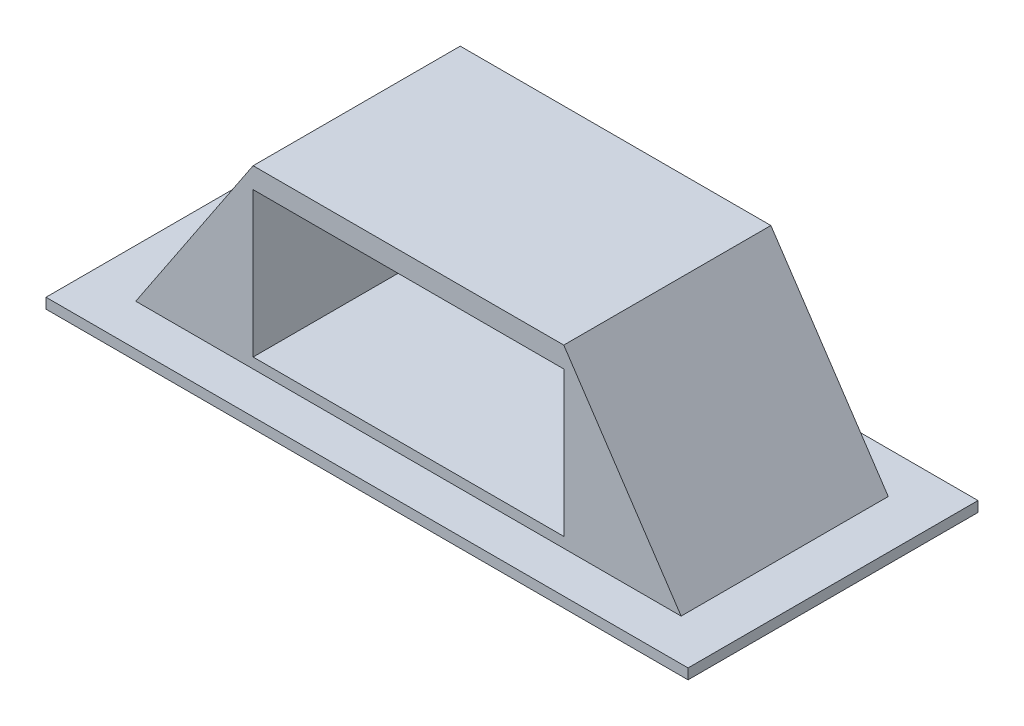
ISO-10303-21;
HEADER;
FILE_DESCRIPTION(('STEP AP214'),'2;1');
FILE_NAME('part.step','',(''),(''),'','','');
FILE_SCHEMA(('AUTOMOTIVE_DESIGN { 1 0 10303 214 1 1 1 1 }'));
ENDSEC;
DATA;
#1=APPLICATION_CONTEXT('core data for automotive mechanical design processes');
#2=APPLICATION_PROTOCOL_DEFINITION('international standard','automotive_design',2000,#1);
#3=PRODUCT_CONTEXT('',#1,'mechanical');
#4=PRODUCT('Part','Part','',(#3));
#5=PRODUCT_RELATED_PRODUCT_CATEGORY('part','',(#4));
#6=PRODUCT_DEFINITION_FORMATION('','',#4);
#7=PRODUCT_DEFINITION_CONTEXT('part definition',#1,'design');
#8=PRODUCT_DEFINITION('design','',#6,#7);
#9=PRODUCT_DEFINITION_SHAPE('','',#8);
#10=(LENGTH_UNIT() NAMED_UNIT(*) SI_UNIT(.MILLI.,.METRE.));
#11=(NAMED_UNIT(*) PLANE_ANGLE_UNIT() SI_UNIT($,.RADIAN.));
#12=(NAMED_UNIT(*) SI_UNIT($,.STERADIAN.) SOLID_ANGLE_UNIT());
#13=UNCERTAINTY_MEASURE_WITH_UNIT(LENGTH_MEASURE(1.E-05),#10,'distance_accuracy_value','');
#14=(GEOMETRIC_REPRESENTATION_CONTEXT(3) GLOBAL_UNCERTAINTY_ASSIGNED_CONTEXT((#13)) GLOBAL_UNIT_ASSIGNED_CONTEXT((#10,
#11,#12)) REPRESENTATION_CONTEXT('',''));
#15=CARTESIAN_POINT('',(0.,0.,0.));
#16=DIRECTION('',(0.,0.,1.));
#17=DIRECTION('',(1.,0.,0.));
#18=AXIS2_PLACEMENT_3D('',#15,#16,#17);
#19=CARTESIAN_POINT('',(-75.,90.,50.));
#20=DIRECTION('',(0.,0.,-1.));
#21=DIRECTION('',(-1.,0.,0.));
#22=AXIS2_PLACEMENT_3D('',#19,#20,#21);
#23=PLANE('',#22);
#24=DIRECTION('',(0.,-1.,0.));
#25=VECTOR('',#24,1.);
#26=CARTESIAN_POINT('',(-75.,0.,50.));
#27=LINE('',#26,#25);
#28=CARTESIAN_POINT('',(-75.,80.,50.));
#29=VERTEX_POINT('',#28);
#30=CARTESIAN_POINT('',(-75.,9.99999999999999,50.));
#31=VERTEX_POINT('',#30);
#32=EDGE_CURVE('E193',#29,#31,#27,.T.);
#33=ORIENTED_EDGE('',*,*,#32,.F.);
#34=DIRECTION('',(1.,0.,0.));
#35=VECTOR('',#34,1.);
#36=CARTESIAN_POINT('',(0.,80.,50.));
#37=LINE('',#36,#35);
#38=CARTESIAN_POINT('',(75.,80.,50.));
#39=VERTEX_POINT('',#38);
#40=EDGE_CURVE('E217',#29,#39,#37,.T.);
#41=ORIENTED_EDGE('',*,*,#40,.T.);
#42=DIRECTION('',(0.,1.,0.));
#43=VECTOR('',#42,1.);
#44=CARTESIAN_POINT('',(75.,0.,50.));
#45=LINE('',#44,#43);
#46=CARTESIAN_POINT('',(75.,9.99999999999999,50.));
#47=VERTEX_POINT('',#46);
#48=EDGE_CURVE('E202',#47,#39,#45,.T.);
#49=ORIENTED_EDGE('',*,*,#48,.F.);
#50=DIRECTION('',(1.,0.,0.));
#51=VECTOR('',#50,1.);
#52=CARTESIAN_POINT('',(0.,9.99999999999999,50.));
#53=LINE('',#52,#51);
#54=EDGE_CURVE('E210',#31,#47,#53,.T.);
#55=ORIENTED_EDGE('',*,*,#54,.F.);
#56=EDGE_LOOP('',(#33,#41,#49,#55));
#57=FACE_BOUND('',#56,.T.);
#58=DIRECTION('',(-1.,0.,0.));
#59=VECTOR('',#58,1.);
#60=CARTESIAN_POINT('',(-75.,5.,50.));
#61=LINE('',#60,#59);
#62=CARTESIAN_POINT('',(131.666666666667,5.,50.));
#63=VERTEX_POINT('',#62);
#64=CARTESIAN_POINT('',(-131.666666666667,5.,50.));
#65=VERTEX_POINT('',#64);
#66=EDGE_CURVE('E54',#63,#65,#61,.T.);
#67=ORIENTED_EDGE('',*,*,#66,.F.);
#68=DIRECTION('',(0.554700196225229,-0.832050294337844,0.));
#69=VECTOR('',#68,1.);
#70=CARTESIAN_POINT('',(75.,90.,50.));
#71=LINE('',#70,#69);
#72=CARTESIAN_POINT('',(75.,90.,50.));
#73=VERTEX_POINT('',#72);
#74=EDGE_CURVE('E206',#73,#63,#71,.T.);
#75=ORIENTED_EDGE('',*,*,#74,.F.);
#76=DIRECTION('',(1.,0.,0.));
#77=VECTOR('',#76,1.);
#78=CARTESIAN_POINT('',(-75.,90.,50.));
#79=LINE('',#78,#77);
#80=CARTESIAN_POINT('',(-75.,90.,50.));
#81=VERTEX_POINT('',#80);
#82=EDGE_CURVE('E249',#81,#73,#79,.T.);
#83=ORIENTED_EDGE('',*,*,#82,.F.);
#84=DIRECTION('',(0.554700196225229,0.832050294337844,0.));
#85=VECTOR('',#84,1.);
#86=CARTESIAN_POINT('',(-75.,90.,50.));
#87=LINE('',#86,#85);
#88=EDGE_CURVE('E196',#65,#81,#87,.T.);
#89=ORIENTED_EDGE('',*,*,#88,.F.);
#90=EDGE_LOOP('',(#67,#75,#83,#89));
#91=FACE_BOUND('',#90,.T.);
#92=ADVANCED_FACE('F39',(#57,#91),#23,.F.);
#93=CARTESIAN_POINT('',(-75.,90.,-50.));
#94=DIRECTION('',(0.,0.,1.));
#95=DIRECTION('',(1.,0.,0.));
#96=AXIS2_PLACEMENT_3D('',#93,#94,#95);
#97=PLANE('',#96);
#98=DIRECTION('',(1.,0.,0.));
#99=VECTOR('',#98,1.);
#100=CARTESIAN_POINT('',(-75.,5.,-50.));
#101=LINE('',#100,#99);
#102=CARTESIAN_POINT('',(-131.666666666667,5.,-50.));
#103=VERTEX_POINT('',#102);
#104=CARTESIAN_POINT('',(131.666666666667,5.,-50.));
#105=VERTEX_POINT('',#104);
#106=EDGE_CURVE('E178',#103,#105,#101,.T.);
#107=ORIENTED_EDGE('',*,*,#106,.F.);
#108=DIRECTION('',(0.554700196225229,0.832050294337844,0.));
#109=VECTOR('',#108,1.);
#110=CARTESIAN_POINT('',(-75.,90.,-50.));
#111=LINE('',#110,#109);
#112=CARTESIAN_POINT('',(-75.,90.,-50.));
#113=VERTEX_POINT('',#112);
#114=EDGE_CURVE('E192',#103,#113,#111,.T.);
#115=ORIENTED_EDGE('',*,*,#114,.T.);
#116=DIRECTION('',(-1.,0.,0.));
#117=VECTOR('',#116,1.);
#118=CARTESIAN_POINT('',(-75.,90.,-50.));
#119=LINE('',#118,#117);
#120=CARTESIAN_POINT('',(75.,90.,-50.));
#121=VERTEX_POINT('',#120);
#122=EDGE_CURVE('E47',#121,#113,#119,.T.);
#123=ORIENTED_EDGE('',*,*,#122,.F.);
#124=DIRECTION('',(0.554700196225229,-0.832050294337844,0.));
#125=VECTOR('',#124,1.);
#126=CARTESIAN_POINT('',(75.,90.,-50.));
#127=LINE('',#126,#125);
#128=EDGE_CURVE('E199',#121,#105,#127,.T.);
#129=ORIENTED_EDGE('',*,*,#128,.T.);
#130=EDGE_LOOP('',(#107,#115,#123,#129));
#131=FACE_BOUND('',#130,.T.);
#132=ADVANCED_FACE('F264',(#131),#97,.F.);
#133=CARTESIAN_POINT('',(75.,90.,50.));
#134=DIRECTION('',(0.832050294337844,0.554700196225229,0.));
#135=DIRECTION('',(-0.554700196225229,0.832050294337844,0.));
#136=AXIS2_PLACEMENT_3D('',#133,#134,#135);
#137=PLANE('',#136);
#138=ORIENTED_EDGE('',*,*,#74,.T.);
#139=DIRECTION('',(0.,0.,-1.));
#140=VECTOR('',#139,1.);
#141=CARTESIAN_POINT('',(131.666666666667,5.,50.));
#142=LINE('',#141,#140);
#143=EDGE_CURVE('E188',#63,#105,#142,.T.);
#144=ORIENTED_EDGE('',*,*,#143,.T.);
#145=ORIENTED_EDGE('',*,*,#128,.F.);
#146=DIRECTION('',(0.,0.,-1.));
#147=VECTOR('',#146,1.);
#148=CARTESIAN_POINT('',(75.,90.,-50.));
#149=LINE('',#148,#147);
#150=EDGE_CURVE('E252',#73,#121,#149,.T.);
#151=ORIENTED_EDGE('',*,*,#150,.F.);
#152=EDGE_LOOP('',(#138,#144,#145,#151));
#153=FACE_BOUND('',#152,.T.);
#154=ADVANCED_FACE('F267',(#153),#137,.T.);
#155=CARTESIAN_POINT('',(-75.,90.,50.));
#156=DIRECTION('',(-0.832050294337844,0.554700196225229,0.));
#157=DIRECTION('',(-0.554700196225229,-0.832050294337844,0.));
#158=AXIS2_PLACEMENT_3D('',#155,#156,#157);
#159=PLANE('',#158);
#160=ORIENTED_EDGE('',*,*,#114,.F.);
#161=DIRECTION('',(0.,0.,1.));
#162=VECTOR('',#161,1.);
#163=CARTESIAN_POINT('',(-131.666666666667,5.,50.));
#164=LINE('',#163,#162);
#165=EDGE_CURVE('E11',#103,#65,#164,.T.);
#166=ORIENTED_EDGE('',*,*,#165,.T.);
#167=ORIENTED_EDGE('',*,*,#88,.T.);
#168=DIRECTION('',(0.,0.,1.));
#169=VECTOR('',#168,1.);
#170=CARTESIAN_POINT('',(-75.,90.,-50.));
#171=LINE('',#170,#169);
#172=EDGE_CURVE('E235',#113,#81,#171,.T.);
#173=ORIENTED_EDGE('',*,*,#172,.F.);
#174=EDGE_LOOP('',(#160,#166,#167,#173));
#175=FACE_BOUND('',#174,.T.);
#176=ADVANCED_FACE('F273',(#175),#159,.T.);
#177=CARTESIAN_POINT('',(0.,90.,0.));
#178=DIRECTION('',(0.,1.,0.));
#179=DIRECTION('',(0.,0.,1.));
#180=AXIS2_PLACEMENT_3D('',#177,#178,#179);
#181=PLANE('',#180);
#182=ORIENTED_EDGE('',*,*,#172,.T.);
#183=ORIENTED_EDGE('',*,*,#82,.T.);
#184=ORIENTED_EDGE('',*,*,#150,.T.);
#185=ORIENTED_EDGE('',*,*,#122,.T.);
#186=EDGE_LOOP('',(#182,#183,#184,#185));
#187=FACE_BOUND('',#186,.T.);
#188=ADVANCED_FACE('F258',(#187),#181,.T.);
#189=CARTESIAN_POINT('',(0.,80.,-30.));
#190=DIRECTION('',(0.,-1.,0.));
#191=DIRECTION('',(0.,0.,-1.));
#192=AXIS2_PLACEMENT_3D('',#189,#190,#191);
#193=PLANE('',#192);
#194=ORIENTED_EDGE('',*,*,#40,.F.);
#195=DIRECTION('',(0.,0.,1.));
#196=VECTOR('',#195,1.);
#197=CARTESIAN_POINT('',(-75.,80.,-30.));
#198=LINE('',#197,#196);
#199=CARTESIAN_POINT('',(-75.,80.,-30.));
#200=VERTEX_POINT('',#199);
#201=EDGE_CURVE('E232',#200,#29,#198,.T.);
#202=ORIENTED_EDGE('',*,*,#201,.F.);
#203=DIRECTION('',(1.,0.,0.));
#204=VECTOR('',#203,1.);
#205=CARTESIAN_POINT('',(0.,80.,-30.));
#206=LINE('',#205,#204);
#207=CARTESIAN_POINT('',(75.,80.,-30.));
#208=VERTEX_POINT('',#207);
#209=EDGE_CURVE('E223',#200,#208,#206,.T.);
#210=ORIENTED_EDGE('',*,*,#209,.T.);
#211=DIRECTION('',(0.,0.,1.));
#212=VECTOR('',#211,1.);
#213=CARTESIAN_POINT('',(75.,80.,-30.));
#214=LINE('',#213,#212);
#215=EDGE_CURVE('E236',#208,#39,#214,.T.);
#216=ORIENTED_EDGE('',*,*,#215,.T.);
#217=EDGE_LOOP('',(#194,#202,#210,#216));
#218=FACE_BOUND('',#217,.T.);
#219=ADVANCED_FACE('F280',(#218),#193,.T.);
#220=CARTESIAN_POINT('',(0.,9.99999999999999,-30.));
#221=DIRECTION('',(0.,-1.,0.));
#222=DIRECTION('',(0.,0.,-1.));
#223=AXIS2_PLACEMENT_3D('',#220,#221,#222);
#224=PLANE('',#223);
#225=ORIENTED_EDGE('',*,*,#54,.T.);
#226=DIRECTION('',(0.,0.,1.));
#227=VECTOR('',#226,1.);
#228=CARTESIAN_POINT('',(75.,9.99999999999999,-30.));
#229=LINE('',#228,#227);
#230=CARTESIAN_POINT('',(75.,9.99999999999999,-30.));
#231=VERTEX_POINT('',#230);
#232=EDGE_CURVE('E239',#231,#47,#229,.T.);
#233=ORIENTED_EDGE('',*,*,#232,.F.);
#234=DIRECTION('',(1.,0.,0.));
#235=VECTOR('',#234,1.);
#236=CARTESIAN_POINT('',(0.,9.99999999999999,-30.));
#237=LINE('',#236,#235);
#238=CARTESIAN_POINT('',(-75.,9.99999999999999,-30.));
#239=VERTEX_POINT('',#238);
#240=EDGE_CURVE('E61',#239,#231,#237,.T.);
#241=ORIENTED_EDGE('',*,*,#240,.F.);
#242=DIRECTION('',(0.,0.,1.));
#243=VECTOR('',#242,1.);
#244=CARTESIAN_POINT('',(-75.,9.99999999999999,-30.));
#245=LINE('',#244,#243);
#246=EDGE_CURVE('E226',#239,#31,#245,.T.);
#247=ORIENTED_EDGE('',*,*,#246,.T.);
#248=EDGE_LOOP('',(#225,#233,#241,#247));
#249=FACE_BOUND('',#248,.T.);
#250=ADVANCED_FACE('F303',(#249),#224,.F.);
#251=CARTESIAN_POINT('',(0.,0.,-30.));
#252=DIRECTION('',(0.,0.,1.));
#253=DIRECTION('',(1.,0.,0.));
#254=AXIS2_PLACEMENT_3D('',#251,#252,#253);
#255=PLANE('',#254);
#256=DIRECTION('',(0.,-1.,0.));
#257=VECTOR('',#256,1.);
#258=CARTESIAN_POINT('',(-75.,0.,-30.));
#259=LINE('',#258,#257);
#260=EDGE_CURVE('E214',#200,#239,#259,.T.);
#261=ORIENTED_EDGE('',*,*,#260,.T.);
#262=ORIENTED_EDGE('',*,*,#240,.T.);
#263=DIRECTION('',(0.,1.,0.));
#264=VECTOR('',#263,1.);
#265=CARTESIAN_POINT('',(75.,0.,-30.));
#266=LINE('',#265,#264);
#267=EDGE_CURVE('E220',#231,#208,#266,.T.);
#268=ORIENTED_EDGE('',*,*,#267,.T.);
#269=ORIENTED_EDGE('',*,*,#209,.F.);
#270=EDGE_LOOP('',(#261,#262,#268,#269));
#271=FACE_BOUND('',#270,.T.);
#272=ADVANCED_FACE('F305',(#271),#255,.T.);
#273=CARTESIAN_POINT('',(75.,0.,50.));
#274=DIRECTION('',(-1.,0.,0.));
#275=DIRECTION('',(0.,0.,1.));
#276=AXIS2_PLACEMENT_3D('',#273,#274,#275);
#277=PLANE('',#276);
#278=ORIENTED_EDGE('',*,*,#215,.F.);
#279=ORIENTED_EDGE('',*,*,#267,.F.);
#280=ORIENTED_EDGE('',*,*,#232,.T.);
#281=ORIENTED_EDGE('',*,*,#48,.T.);
#282=EDGE_LOOP('',(#278,#279,#280,#281));
#283=FACE_BOUND('',#282,.T.);
#284=ADVANCED_FACE('F301',(#283),#277,.T.);
#285=CARTESIAN_POINT('',(-75.,0.,50.));
#286=DIRECTION('',(1.,0.,0.));
#287=DIRECTION('',(0.,1.,0.));
#288=AXIS2_PLACEMENT_3D('',#285,#286,#287);
#289=PLANE('',#288);
#290=ORIENTED_EDGE('',*,*,#260,.F.);
#291=ORIENTED_EDGE('',*,*,#201,.T.);
#292=ORIENTED_EDGE('',*,*,#32,.T.);
#293=ORIENTED_EDGE('',*,*,#246,.F.);
#294=EDGE_LOOP('',(#290,#291,#292,#293));
#295=FACE_BOUND('',#294,.T.);
#296=ADVANCED_FACE('F304',(#295),#289,.T.);
#297=CARTESIAN_POINT('',(-155.,5.,70.));
#298=DIRECTION('',(-1.,0.,0.));
#299=DIRECTION('',(0.,0.,1.));
#300=AXIS2_PLACEMENT_3D('',#297,#298,#299);
#301=PLANE('',#300);
#302=DIRECTION('',(0.,0.,-1.));
#303=VECTOR('',#302,1.);
#304=CARTESIAN_POINT('',(-155.,0.,70.));
#305=LINE('',#304,#303);
#306=CARTESIAN_POINT('',(-155.,0.,70.));
#307=VERTEX_POINT('',#306);
#308=CARTESIAN_POINT('',(-155.,0.,-70.));
#309=VERTEX_POINT('',#308);
#310=EDGE_CURVE('E168',#307,#309,#305,.T.);
#311=ORIENTED_EDGE('',*,*,#310,.F.);
#312=DIRECTION('',(0.,-1.,0.));
#313=VECTOR('',#312,1.);
#314=CARTESIAN_POINT('',(-155.,5.,70.));
#315=LINE('',#314,#313);
#316=CARTESIAN_POINT('',(-155.,5.,70.));
#317=VERTEX_POINT('',#316);
#318=EDGE_CURVE('E155',#317,#307,#315,.T.);
#319=ORIENTED_EDGE('',*,*,#318,.F.);
#320=DIRECTION('',(0.,0.,-1.));
#321=VECTOR('',#320,1.);
#322=CARTESIAN_POINT('',(-155.,5.,70.));
#323=LINE('',#322,#321);
#324=CARTESIAN_POINT('',(-155.,5.,-70.));
#325=VERTEX_POINT('',#324);
#326=EDGE_CURVE('E148',#317,#325,#323,.T.);
#327=ORIENTED_EDGE('',*,*,#326,.T.);
#328=DIRECTION('',(0.,-1.,0.));
#329=VECTOR('',#328,1.);
#330=CARTESIAN_POINT('',(-155.,5.,-70.));
#331=LINE('',#330,#329);
#332=EDGE_CURVE('E129',#325,#309,#331,.T.);
#333=ORIENTED_EDGE('',*,*,#332,.T.);
#334=EDGE_LOOP('',(#311,#319,#327,#333));
#335=FACE_BOUND('',#334,.T.);
#336=ADVANCED_FACE('F154',(#335),#301,.T.);
#337=CARTESIAN_POINT('',(-155.,5.,70.));
#338=DIRECTION('',(0.,0.,1.));
#339=DIRECTION('',(1.,0.,0.));
#340=AXIS2_PLACEMENT_3D('',#337,#338,#339);
#341=PLANE('',#340);
#342=DIRECTION('',(-1.,0.,0.));
#343=VECTOR('',#342,1.);
#344=CARTESIAN_POINT('',(-155.,0.,70.));
#345=LINE('',#344,#343);
#346=CARTESIAN_POINT('',(155.,0.,70.));
#347=VERTEX_POINT('',#346);
#348=EDGE_CURVE('E157',#347,#307,#345,.T.);
#349=ORIENTED_EDGE('',*,*,#348,.F.);
#350=DIRECTION('',(0.,-1.,0.));
#351=VECTOR('',#350,1.);
#352=CARTESIAN_POINT('',(155.,5.,70.));
#353=LINE('',#352,#351);
#354=CARTESIAN_POINT('',(155.,5.,70.));
#355=VERTEX_POINT('',#354);
#356=EDGE_CURVE('E179',#355,#347,#353,.T.);
#357=ORIENTED_EDGE('',*,*,#356,.F.);
#358=DIRECTION('',(-1.,0.,0.));
#359=VECTOR('',#358,1.);
#360=CARTESIAN_POINT('',(-155.,5.,70.));
#361=LINE('',#360,#359);
#362=EDGE_CURVE('E141',#355,#317,#361,.T.);
#363=ORIENTED_EDGE('',*,*,#362,.T.);
#364=ORIENTED_EDGE('',*,*,#318,.T.);
#365=EDGE_LOOP('',(#349,#357,#363,#364));
#366=FACE_BOUND('',#365,.T.);
#367=ADVANCED_FACE('F327',(#366),#341,.T.);
#368=CARTESIAN_POINT('',(155.,5.,70.));
#369=DIRECTION('',(1.,0.,0.));
#370=DIRECTION('',(0.,0.,-1.));
#371=AXIS2_PLACEMENT_3D('',#368,#369,#370);
#372=PLANE('',#371);
#373=DIRECTION('',(0.,0.,1.));
#374=VECTOR('',#373,1.);
#375=CARTESIAN_POINT('',(155.,0.,70.));
#376=LINE('',#375,#374);
#377=CARTESIAN_POINT('',(155.,0.,-70.));
#378=VERTEX_POINT('',#377);
#379=EDGE_CURVE('E161',#378,#347,#376,.T.);
#380=ORIENTED_EDGE('',*,*,#379,.F.);
#381=DIRECTION('',(0.,-1.,0.));
#382=VECTOR('',#381,1.);
#383=CARTESIAN_POINT('',(155.,5.,-70.));
#384=LINE('',#383,#382);
#385=CARTESIAN_POINT('',(155.,5.,-70.));
#386=VERTEX_POINT('',#385);
#387=EDGE_CURVE('E140',#386,#378,#384,.T.);
#388=ORIENTED_EDGE('',*,*,#387,.F.);
#389=DIRECTION('',(0.,0.,1.));
#390=VECTOR('',#389,1.);
#391=CARTESIAN_POINT('',(155.,5.,70.));
#392=LINE('',#391,#390);
#393=EDGE_CURVE('E151',#386,#355,#392,.T.);
#394=ORIENTED_EDGE('',*,*,#393,.T.);
#395=ORIENTED_EDGE('',*,*,#356,.T.);
#396=EDGE_LOOP('',(#380,#388,#394,#395));
#397=FACE_BOUND('',#396,.T.);
#398=ADVANCED_FACE('F329',(#397),#372,.T.);
#399=CARTESIAN_POINT('',(-155.,5.,-70.));
#400=DIRECTION('',(0.,0.,-1.));
#401=DIRECTION('',(-1.,0.,0.));
#402=AXIS2_PLACEMENT_3D('',#399,#400,#401);
#403=PLANE('',#402);
#404=DIRECTION('',(1.,0.,0.));
#405=VECTOR('',#404,1.);
#406=CARTESIAN_POINT('',(-155.,0.,-70.));
#407=LINE('',#406,#405);
#408=EDGE_CURVE('E134',#309,#378,#407,.T.);
#409=ORIENTED_EDGE('',*,*,#408,.F.);
#410=ORIENTED_EDGE('',*,*,#332,.F.);
#411=DIRECTION('',(1.,0.,0.));
#412=VECTOR('',#411,1.);
#413=CARTESIAN_POINT('',(-155.,5.,-70.));
#414=LINE('',#413,#412);
#415=EDGE_CURVE('E132',#325,#386,#414,.T.);
#416=ORIENTED_EDGE('',*,*,#415,.T.);
#417=ORIENTED_EDGE('',*,*,#387,.T.);
#418=EDGE_LOOP('',(#409,#410,#416,#417));
#419=FACE_BOUND('',#418,.T.);
#420=ADVANCED_FACE('F131',(#419),#403,.T.);
#421=CARTESIAN_POINT('',(0.,5.,0.));
#422=DIRECTION('',(0.,-1.,0.));
#423=DIRECTION('',(0.,0.,-1.));
#424=AXIS2_PLACEMENT_3D('',#421,#422,#423);
#425=PLANE('',#424);
#426=ORIENTED_EDGE('',*,*,#143,.F.);
#427=ORIENTED_EDGE('',*,*,#66,.T.);
#428=ORIENTED_EDGE('',*,*,#165,.F.);
#429=ORIENTED_EDGE('',*,*,#106,.T.);
#430=EDGE_LOOP('',(#426,#427,#428,#429));
#431=FACE_BOUND('',#430,.T.);
#432=ORIENTED_EDGE('',*,*,#326,.F.);
#433=ORIENTED_EDGE('',*,*,#362,.F.);
#434=ORIENTED_EDGE('',*,*,#393,.F.);
#435=ORIENTED_EDGE('',*,*,#415,.F.);
#436=EDGE_LOOP('',(#432,#433,#434,#435));
#437=FACE_BOUND('',#436,.T.);
#438=ADVANCED_FACE('F146',(#431,#437),#425,.F.);
#439=CARTESIAN_POINT('',(0.,0.,0.));
#440=DIRECTION('',(0.,1.,0.));
#441=DIRECTION('',(0.,0.,1.));
#442=AXIS2_PLACEMENT_3D('',#439,#440,#441);
#443=PLANE('',#442);
#444=ORIENTED_EDGE('',*,*,#310,.T.);
#445=ORIENTED_EDGE('',*,*,#408,.T.);
#446=ORIENTED_EDGE('',*,*,#379,.T.);
#447=ORIENTED_EDGE('',*,*,#348,.T.);
#448=EDGE_LOOP('',(#444,#445,#446,#447));
#449=FACE_BOUND('',#448,.T.);
#450=ADVANCED_FACE('F317',(#449),#443,.F.);
#451=CLOSED_SHELL('',(#92,#132,#154,#176,#188,#219,#250,#272,#284,#296,#336,#367,#398,#420,#438,#450));
#452=MANIFOLD_SOLID_BREP('B2',#451);
#453=ADVANCED_BREP_SHAPE_REPRESENTATION('',(#18,#452),#14);
#454=SHAPE_DEFINITION_REPRESENTATION(#9,#453);
ENDSEC;
END-ISO-10303-21;
